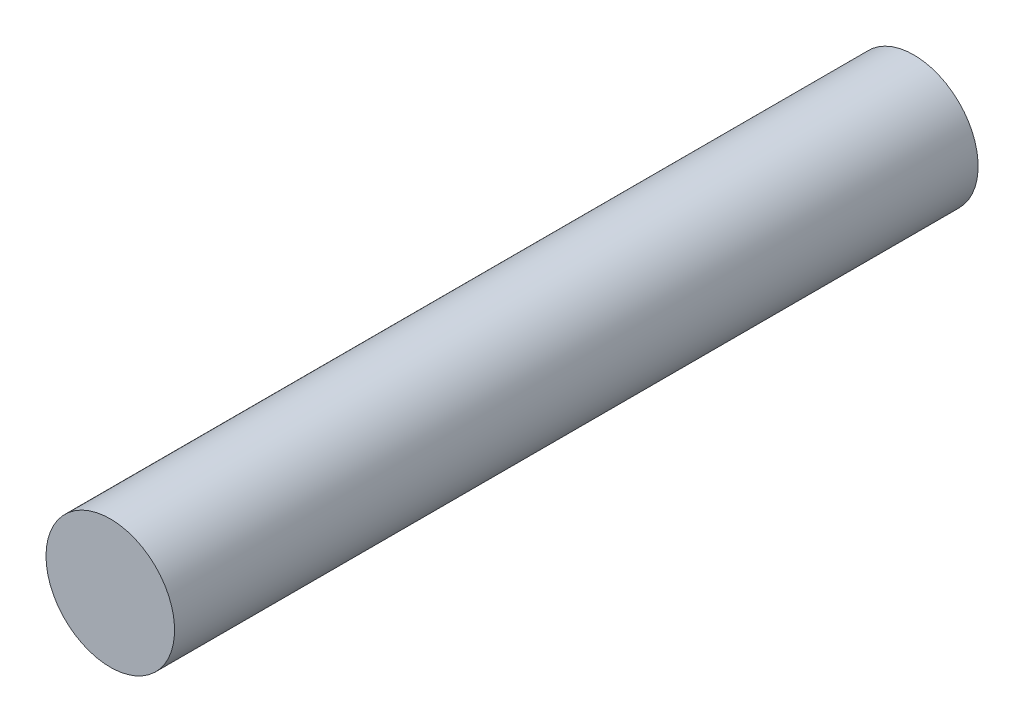
ISO-10303-21;
HEADER;
FILE_DESCRIPTION(('STEP AP214'),'2;1');
FILE_NAME('part.step','',(''),(''),'','','');
FILE_SCHEMA(('AUTOMOTIVE_DESIGN { 1 0 10303 214 1 1 1 1 }'));
ENDSEC;
DATA;
#1=APPLICATION_CONTEXT('core data for automotive mechanical design processes');
#2=APPLICATION_PROTOCOL_DEFINITION('international standard','automotive_design',2000,#1);
#3=PRODUCT_CONTEXT('',#1,'mechanical');
#4=PRODUCT('Part','Part','',(#3));
#5=PRODUCT_RELATED_PRODUCT_CATEGORY('part','',(#4));
#6=PRODUCT_DEFINITION_FORMATION('','',#4);
#7=PRODUCT_DEFINITION_CONTEXT('part definition',#1,'design');
#8=PRODUCT_DEFINITION('design','',#6,#7);
#9=PRODUCT_DEFINITION_SHAPE('','',#8);
#10=(LENGTH_UNIT() NAMED_UNIT(*) SI_UNIT(.MILLI.,.METRE.));
#11=(NAMED_UNIT(*) PLANE_ANGLE_UNIT() SI_UNIT($,.RADIAN.));
#12=(NAMED_UNIT(*) SI_UNIT($,.STERADIAN.) SOLID_ANGLE_UNIT());
#13=UNCERTAINTY_MEASURE_WITH_UNIT(LENGTH_MEASURE(1.E-05),#10,'distance_accuracy_value','');
#14=(GEOMETRIC_REPRESENTATION_CONTEXT(3) GLOBAL_UNCERTAINTY_ASSIGNED_CONTEXT((#13)) GLOBAL_UNIT_ASSIGNED_CONTEXT((#10,
#11,#12)) REPRESENTATION_CONTEXT('',''));
#15=CARTESIAN_POINT('',(0.,0.,0.));
#16=DIRECTION('',(0.,0.,1.));
#17=DIRECTION('',(1.,0.,0.));
#18=AXIS2_PLACEMENT_3D('',#15,#16,#17);
#19=CARTESIAN_POINT('',(0.3999992,0.,5.00000016));
#20=DIRECTION('',(0.,0.,-1.));
#21=DIRECTION('',(0.,-1.,0.));
#22=AXIS2_PLACEMENT_3D('',#19,#20,#21);
#23=PLANE('',#22);
#24=CARTESIAN_POINT('',(0.,0.,5.00000016));
#25=DIRECTION('',(0.,0.,1.));
#26=DIRECTION('',(1.,0.,0.));
#27=AXIS2_PLACEMENT_3D('',#24,#25,#26);
#28=CIRCLE('',#27,0.3999992);
#29=CARTESIAN_POINT('',(-0.3999992,0.,5.00000016));
#30=VERTEX_POINT('',#29);
#31=EDGE_CURVE('E11',#30,#30,#28,.T.);
#32=ORIENTED_EDGE('',*,*,#31,.T.);
#33=EDGE_LOOP('',(#32));
#34=FACE_BOUND('',#33,.T.);
#35=ADVANCED_FACE('F17',(#34),#23,.F.);
#36=CARTESIAN_POINT('',(0.3999992,0.,0.));
#37=DIRECTION('',(0.,0.,-1.));
#38=DIRECTION('',(0.,-1.,0.));
#39=AXIS2_PLACEMENT_3D('',#36,#37,#38);
#40=PLANE('',#39);
#41=CARTESIAN_POINT('',(0.,0.,0.));
#42=DIRECTION('',(0.,0.,1.));
#43=DIRECTION('',(1.,0.,0.));
#44=AXIS2_PLACEMENT_3D('',#41,#42,#43);
#45=CIRCLE('',#44,0.3999992);
#46=CARTESIAN_POINT('',(-0.3999992,0.,0.));
#47=VERTEX_POINT('',#46);
#48=EDGE_CURVE('E43',#47,#47,#45,.T.);
#49=ORIENTED_EDGE('',*,*,#48,.F.);
#50=EDGE_LOOP('',(#49));
#51=FACE_BOUND('',#50,.T.);
#52=ADVANCED_FACE('F19',(#51),#40,.T.);
#53=CARTESIAN_POINT('',(0.,0.,0.));
#54=DIRECTION('',(0.,0.,-1.));
#55=DIRECTION('',(1.,0.,0.));
#56=AXIS2_PLACEMENT_3D('',#53,#54,#55);
#57=CYLINDRICAL_SURFACE('',#56,0.3999992);
#58=ORIENTED_EDGE('',*,*,#48,.T.);
#59=DIRECTION('',(0.,0.,1.));
#60=VECTOR('',#59,1.);
#61=CARTESIAN_POINT('',(-0.3999992,0.,0.));
#62=LINE('',#61,#60);
#63=EDGE_CURVE('E27',#47,#30,#62,.T.);
#64=ORIENTED_EDGE('',*,*,#63,.T.);
#65=ORIENTED_EDGE('',*,*,#31,.F.);
#66=ORIENTED_EDGE('',*,*,#63,.F.);
#67=EDGE_LOOP('',(#58,#64,#65,#66));
#68=FACE_BOUND('',#67,.T.);
#69=ADVANCED_FACE('F41',(#68),#57,.T.);
#70=CLOSED_SHELL('',(#35,#52,#69));
#71=MANIFOLD_SOLID_BREP('B1',#70);
#72=ADVANCED_BREP_SHAPE_REPRESENTATION('',(#18,#71),#14);
#73=SHAPE_DEFINITION_REPRESENTATION(#9,#72);
ENDSEC;
END-ISO-10303-21;
